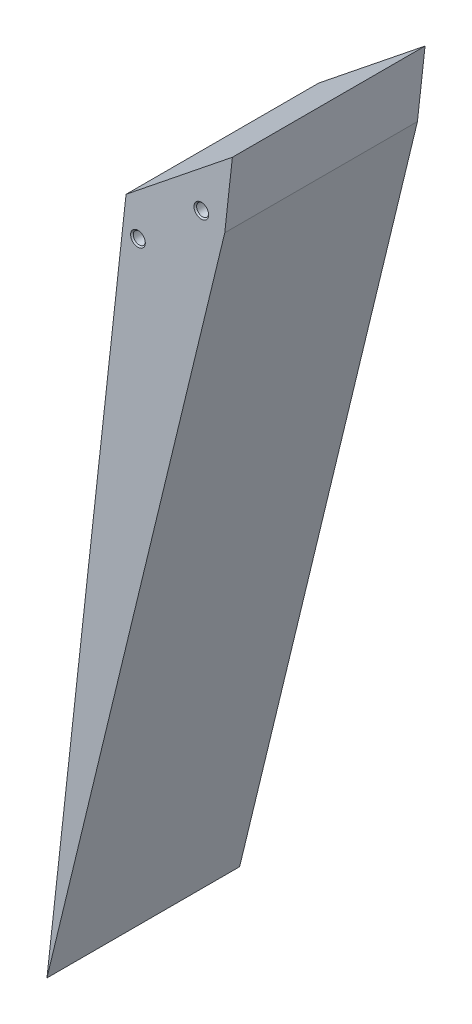
ISO-10303-21;
HEADER;
FILE_DESCRIPTION(('STEP AP214'),'2;1');
FILE_NAME('part.step','',(''),(''),'','','');
FILE_SCHEMA(('AUTOMOTIVE_DESIGN { 1 0 10303 214 1 1 1 1 }'));
ENDSEC;
DATA;
#1=APPLICATION_CONTEXT('core data for automotive mechanical design processes');
#2=APPLICATION_PROTOCOL_DEFINITION('international standard','automotive_design',2000,#1);
#3=PRODUCT_CONTEXT('',#1,'mechanical');
#4=PRODUCT('Part','Part','',(#3));
#5=PRODUCT_RELATED_PRODUCT_CATEGORY('part','',(#4));
#6=PRODUCT_DEFINITION_FORMATION('','',#4);
#7=PRODUCT_DEFINITION_CONTEXT('part definition',#1,'design');
#8=PRODUCT_DEFINITION('design','',#6,#7);
#9=PRODUCT_DEFINITION_SHAPE('','',#8);
#10=(LENGTH_UNIT() NAMED_UNIT(*) SI_UNIT(.MILLI.,.METRE.));
#11=(NAMED_UNIT(*) PLANE_ANGLE_UNIT() SI_UNIT($,.RADIAN.));
#12=(NAMED_UNIT(*) SI_UNIT($,.STERADIAN.) SOLID_ANGLE_UNIT());
#13=UNCERTAINTY_MEASURE_WITH_UNIT(LENGTH_MEASURE(1.E-05),#10,'distance_accuracy_value','');
#14=(GEOMETRIC_REPRESENTATION_CONTEXT(3) GLOBAL_UNCERTAINTY_ASSIGNED_CONTEXT((#13)) GLOBAL_UNIT_ASSIGNED_CONTEXT((#10,
#11,#12)) REPRESENTATION_CONTEXT('',''));
#15=CARTESIAN_POINT('',(0.,0.,0.));
#16=DIRECTION('',(0.,0.,1.));
#17=DIRECTION('',(1.,0.,0.));
#18=AXIS2_PLACEMENT_3D('',#15,#16,#17);
#19=CARTESIAN_POINT('',(8.23788264058282,-16.5449980445284,40.));
#20=DIRECTION('',(-0.993986963738748,0.109498474498163,0.));
#21=DIRECTION('',(-0.109498474498163,-0.993986963738748,0.));
#22=AXIS2_PLACEMENT_3D('',#19,#20,#21);
#23=PLANE('',#22);
#24=DIRECTION('',(0.109498474498163,0.993986963738748,0.));
#25=VECTOR('',#24,1.);
#26=CARTESIAN_POINT('',(8.23788264058282,-16.5449980445284,0.));
#27=LINE('',#26,#25);
#28=CARTESIAN_POINT('',(6.65491540244259,-30.9145936571441,0.));
#29=VERTEX_POINT('',#28);
#30=CARTESIAN_POINT('',(8.23788264058282,-16.5449980445284,0.));
#31=VERTEX_POINT('',#30);
#32=EDGE_CURVE('E155',#29,#31,#27,.T.);
#33=ORIENTED_EDGE('',*,*,#32,.T.);
#34=DIRECTION('',(0.,0.,-1.));
#35=VECTOR('',#34,1.);
#36=CARTESIAN_POINT('',(8.23788264058282,-16.5449980445284,40.));
#37=LINE('',#36,#35);
#38=CARTESIAN_POINT('',(8.23788264058282,-16.5449980445284,40.));
#39=VERTEX_POINT('',#38);
#40=EDGE_CURVE('E11',#39,#31,#37,.T.);
#41=ORIENTED_EDGE('',*,*,#40,.F.);
#42=DIRECTION('',(0.109498474498163,0.993986963738748,0.));
#43=VECTOR('',#42,1.);
#44=CARTESIAN_POINT('',(8.23788264058282,-16.5449980445284,40.));
#45=LINE('',#44,#43);
#46=CARTESIAN_POINT('',(6.65491540244259,-30.9145936571441,40.));
#47=VERTEX_POINT('',#46);
#48=EDGE_CURVE('E156',#47,#39,#45,.T.);
#49=ORIENTED_EDGE('',*,*,#48,.F.);
#50=DIRECTION('',(0.,0.,-1.));
#51=VECTOR('',#50,1.);
#52=CARTESIAN_POINT('',(6.65491540244259,-30.9145936571441,40.));
#53=LINE('',#52,#51);
#54=EDGE_CURVE('E162',#47,#29,#53,.T.);
#55=ORIENTED_EDGE('',*,*,#54,.T.);
#56=EDGE_LOOP('',(#33,#41,#49,#55));
#57=FACE_BOUND('',#56,.T.);
#58=ADVANCED_FACE('F51',(#57),#23,.F.);
#59=CARTESIAN_POINT('',(8.23788264058282,-16.5449980445284,40.));
#60=DIRECTION('',(0.62542780862346,-0.780282036317931,0.));
#61=DIRECTION('',(0.780282036317931,0.62542780862346,0.));
#62=AXIS2_PLACEMENT_3D('',#59,#60,#61);
#63=PLANE('',#62);
#64=DIRECTION('',(-0.780282036317931,-0.62542780862346,0.));
#65=VECTOR('',#64,1.);
#66=CARTESIAN_POINT('',(8.23788264058282,-16.5449980445284,0.));
#67=LINE('',#66,#65);
#68=CARTESIAN_POINT('',(-13.8318261241554,-34.23476782934,0.));
#69=VERTEX_POINT('',#68);
#70=EDGE_CURVE('E165',#31,#69,#67,.T.);
#71=ORIENTED_EDGE('',*,*,#70,.T.);
#72=DIRECTION('',(0.,0.,-1.));
#73=VECTOR('',#72,1.);
#74=CARTESIAN_POINT('',(-13.8318261241554,-34.23476782934,40.));
#75=LINE('',#74,#73);
#76=CARTESIAN_POINT('',(-13.8318261241554,-34.23476782934,40.));
#77=VERTEX_POINT('',#76);
#78=EDGE_CURVE('E59',#77,#69,#75,.T.);
#79=ORIENTED_EDGE('',*,*,#78,.F.);
#80=DIRECTION('',(-0.780282036317931,-0.62542780862346,0.));
#81=VECTOR('',#80,1.);
#82=CARTESIAN_POINT('',(8.23788264058282,-16.5449980445284,40.));
#83=LINE('',#82,#81);
#84=EDGE_CURVE('E98',#39,#77,#83,.T.);
#85=ORIENTED_EDGE('',*,*,#84,.F.);
#86=ORIENTED_EDGE('',*,*,#40,.T.);
#87=EDGE_LOOP('',(#71,#79,#85,#86));
#88=FACE_BOUND('',#87,.T.);
#89=ADVANCED_FACE('F190',(#88),#63,.F.);
#90=CARTESIAN_POINT('',(-13.8318261241554,-34.23476782934,40.));
#91=DIRECTION('',(0.993986963738748,-0.109498474498163,0.));
#92=DIRECTION('',(0.109498474498163,0.993986963738748,0.));
#93=AXIS2_PLACEMENT_3D('',#90,#91,#92);
#94=PLANE('',#93);
#95=DIRECTION('',(-0.109498474498163,-0.993986963738748,0.));
#96=VECTOR('',#95,1.);
#97=CARTESIAN_POINT('',(-13.8318261241554,-34.23476782934,0.));
#98=LINE('',#97,#96);
#99=CARTESIAN_POINT('',(-30.2565972988798,-183.332812390152,0.));
#100=VERTEX_POINT('',#99);
#101=EDGE_CURVE('E85',#69,#100,#98,.T.);
#102=ORIENTED_EDGE('',*,*,#101,.T.);
#103=DIRECTION('',(0.,0.,-1.));
#104=VECTOR('',#103,1.);
#105=CARTESIAN_POINT('',(-30.2565972988798,-183.332812390152,40.));
#106=LINE('',#105,#104);
#107=CARTESIAN_POINT('',(-30.2565972988798,-183.332812390152,40.));
#108=VERTEX_POINT('',#107);
#109=EDGE_CURVE('E170',#108,#100,#106,.T.);
#110=ORIENTED_EDGE('',*,*,#109,.F.);
#111=DIRECTION('',(-0.109498474498163,-0.993986963738748,0.));
#112=VECTOR('',#111,1.);
#113=CARTESIAN_POINT('',(-13.8318261241554,-34.23476782934,40.));
#114=LINE('',#113,#112);
#115=EDGE_CURVE('E159',#77,#108,#114,.T.);
#116=ORIENTED_EDGE('',*,*,#115,.F.);
#117=ORIENTED_EDGE('',*,*,#78,.T.);
#118=EDGE_LOOP('',(#102,#110,#116,#117));
#119=FACE_BOUND('',#118,.T.);
#120=ADVANCED_FACE('F172',(#119),#94,.F.);
#121=CARTESIAN_POINT('',(-30.2565972988798,-183.332812390152,40.));
#122=DIRECTION('',(-0.971906082834714,0.23536899997426,0.));
#123=DIRECTION('',(-0.23536899997426,-0.971906082834714,0.));
#124=AXIS2_PLACEMENT_3D('',#121,#122,#123);
#125=PLANE('',#124);
#126=DIRECTION('',(0.23536899997426,0.971906082834714,0.));
#127=VECTOR('',#126,1.);
#128=CARTESIAN_POINT('',(-30.2565972988798,-183.332812390152,0.));
#129=LINE('',#128,#127);
#130=EDGE_CURVE('E91',#100,#29,#129,.T.);
#131=ORIENTED_EDGE('',*,*,#130,.T.);
#132=ORIENTED_EDGE('',*,*,#54,.F.);
#133=DIRECTION('',(0.23536899997426,0.971906082834714,0.));
#134=VECTOR('',#133,1.);
#135=CARTESIAN_POINT('',(-30.2565972988798,-183.332812390152,40.));
#136=LINE('',#135,#134);
#137=EDGE_CURVE('E67',#108,#47,#136,.T.);
#138=ORIENTED_EDGE('',*,*,#137,.F.);
#139=ORIENTED_EDGE('',*,*,#109,.T.);
#140=EDGE_LOOP('',(#131,#132,#138,#139));
#141=FACE_BOUND('',#140,.T.);
#142=ADVANCED_FACE('F179',(#141),#125,.F.);
#143=CARTESIAN_POINT('',(0.,0.,40.));
#144=DIRECTION('',(0.,0.,-1.));
#145=DIRECTION('',(-1.,0.,0.));
#146=AXIS2_PLACEMENT_3D('',#143,#144,#145);
#147=PLANE('',#146);
#148=CARTESIAN_POINT('',(-11.3580472823463,-41.0028628504399,40.));
#149=DIRECTION('',(0.,0.,1.));
#150=DIRECTION('',(1.,0.,0.));
#151=AXIS2_PLACEMENT_3D('',#148,#149,#150);
#152=CIRCLE('',#151,1.525);
#153=CARTESIAN_POINT('',(-9.83304728234632,-41.0028628504399,40.));
#154=VERTEX_POINT('',#153);
#155=EDGE_CURVE('E137',#154,#154,#152,.T.);
#156=ORIENTED_EDGE('',*,*,#155,.F.);
#157=EDGE_LOOP('',(#156));
#158=FACE_BOUND('',#157,.T.);
#159=CARTESIAN_POINT('',(1.79447905824701,-29.3731143209146,40.));
#160=DIRECTION('',(0.,0.,1.));
#161=DIRECTION('',(1.,0.,0.));
#162=AXIS2_PLACEMENT_3D('',#159,#160,#161);
#163=CIRCLE('',#162,1.525);
#164=CARTESIAN_POINT('',(3.31947905824701,-29.3731143209146,40.));
#165=VERTEX_POINT('',#164);
#166=EDGE_CURVE('E146',#165,#165,#163,.T.);
#167=ORIENTED_EDGE('',*,*,#166,.F.);
#168=EDGE_LOOP('',(#167));
#169=FACE_BOUND('',#168,.T.);
#170=ORIENTED_EDGE('',*,*,#48,.T.);
#171=ORIENTED_EDGE('',*,*,#84,.T.);
#172=ORIENTED_EDGE('',*,*,#115,.T.);
#173=ORIENTED_EDGE('',*,*,#137,.T.);
#174=EDGE_LOOP('',(#170,#171,#172,#173));
#175=FACE_BOUND('',#174,.T.);
#176=ADVANCED_FACE('F181',(#158,#169,#175),#147,.F.);
#177=CARTESIAN_POINT('',(0.,0.,0.));
#178=DIRECTION('',(0.,0.,-1.));
#179=DIRECTION('',(-1.,0.,0.));
#180=AXIS2_PLACEMENT_3D('',#177,#178,#179);
#181=PLANE('',#180);
#182=CARTESIAN_POINT('',(-11.3580472823463,-41.0028628504399,0.));
#183=DIRECTION('',(0.,0.,-1.));
#184=DIRECTION('',(-1.,0.,0.));
#185=AXIS2_PLACEMENT_3D('',#182,#183,#184);
#186=CIRCLE('',#185,1.525);
#187=CARTESIAN_POINT('',(-12.8830472823463,-41.0028628504399,0.));
#188=VERTEX_POINT('',#187);
#189=EDGE_CURVE('E128',#188,#188,#186,.T.);
#190=ORIENTED_EDGE('',*,*,#189,.F.);
#191=EDGE_LOOP('',(#190));
#192=FACE_BOUND('',#191,.T.);
#193=CARTESIAN_POINT('',(1.79447905824701,-29.3731143209146,0.));
#194=DIRECTION('',(0.,0.,-1.));
#195=DIRECTION('',(-1.,0.,0.));
#196=AXIS2_PLACEMENT_3D('',#193,#194,#195);
#197=CIRCLE('',#196,1.525);
#198=CARTESIAN_POINT('',(0.269479058247011,-29.3731143209146,0.));
#199=VERTEX_POINT('',#198);
#200=EDGE_CURVE('E121',#199,#199,#197,.T.);
#201=ORIENTED_EDGE('',*,*,#200,.F.);
#202=EDGE_LOOP('',(#201));
#203=FACE_BOUND('',#202,.T.);
#204=ORIENTED_EDGE('',*,*,#32,.F.);
#205=ORIENTED_EDGE('',*,*,#130,.F.);
#206=ORIENTED_EDGE('',*,*,#101,.F.);
#207=ORIENTED_EDGE('',*,*,#70,.F.);
#208=EDGE_LOOP('',(#204,#205,#206,#207));
#209=FACE_BOUND('',#208,.T.);
#210=ADVANCED_FACE('F175',(#192,#203,#209),#181,.T.);
#211=CARTESIAN_POINT('',(1.79447905824701,-29.3731143209146,32.5));
#212=DIRECTION('',(0.,0.,1.));
#213=DIRECTION('',(1.,0.,0.));
#214=AXIS2_PLACEMENT_3D('',#211,#212,#213);
#215=CONICAL_SURFACE('',#214,1.25,1.02974425867665);
#216=CARTESIAN_POINT('',(1.79447905824701,-29.3731143209146,31.7489242262155));
#217=VERTEX_POINT('',#216);
#218=VERTEX_LOOP('',#217);
#219=FACE_BOUND('',#218,.T.);
#220=CARTESIAN_POINT('',(1.79447905824701,-29.3731143209146,32.5));
#221=DIRECTION('',(0.,0.,1.));
#222=DIRECTION('',(1.,0.,0.));
#223=AXIS2_PLACEMENT_3D('',#220,#221,#222);
#224=CIRCLE('',#223,1.25);
#225=CARTESIAN_POINT('',(3.04447905824701,-29.3731143209146,32.5));
#226=VERTEX_POINT('',#225);
#227=EDGE_CURVE('E152',#226,#226,#224,.T.);
#228=ORIENTED_EDGE('',*,*,#227,.T.);
#229=EDGE_LOOP('',(#228));
#230=FACE_BOUND('',#229,.T.);
#231=ADVANCED_FACE('F227',(#219,#230),#215,.F.);
#232=CARTESIAN_POINT('',(1.79447905824701,-29.3731143209146,40.));
#233=DIRECTION('',(0.,0.,1.));
#234=DIRECTION('',(1.,0.,0.));
#235=AXIS2_PLACEMENT_3D('',#232,#233,#234);
#236=CYLINDRICAL_SURFACE('',#235,1.25);
#237=ORIENTED_EDGE('',*,*,#227,.F.);
#238=EDGE_LOOP('',(#237));
#239=FACE_BOUND('',#238,.T.);
#240=CARTESIAN_POINT('',(1.79447905824701,-29.3731143209146,39.725));
#241=DIRECTION('',(0.,0.,1.));
#242=DIRECTION('',(1.,0.,0.));
#243=AXIS2_PLACEMENT_3D('',#240,#241,#242);
#244=CIRCLE('',#243,1.25);
#245=CARTESIAN_POINT('',(3.04447905824701,-29.3731143209146,39.725));
#246=VERTEX_POINT('',#245);
#247=EDGE_CURVE('E149',#246,#246,#244,.T.);
#248=ORIENTED_EDGE('',*,*,#247,.T.);
#249=EDGE_LOOP('',(#248));
#250=FACE_BOUND('',#249,.T.);
#251=ADVANCED_FACE('F238',(#239,#250),#236,.F.);
#252=CARTESIAN_POINT('',(1.79447905824701,-29.3731143209146,40.));
#253=DIRECTION('',(0.,0.,1.));
#254=DIRECTION('',(1.,0.,0.));
#255=AXIS2_PLACEMENT_3D('',#252,#253,#254);
#256=CONICAL_SURFACE('',#255,1.525,0.785398163397454);
#257=ORIENTED_EDGE('',*,*,#247,.F.);
#258=EDGE_LOOP('',(#257));
#259=FACE_BOUND('',#258,.T.);
#260=ORIENTED_EDGE('',*,*,#166,.T.);
#261=EDGE_LOOP('',(#260));
#262=FACE_BOUND('',#261,.T.);
#263=ADVANCED_FACE('F249',(#259,#262),#256,.F.);
#264=CARTESIAN_POINT('',(-11.3580472823463,-41.0028628504399,32.5));
#265=DIRECTION('',(0.,0.,1.));
#266=DIRECTION('',(1.,0.,0.));
#267=AXIS2_PLACEMENT_3D('',#264,#265,#266);
#268=CONICAL_SURFACE('',#267,1.25,1.02974425867665);
#269=CARTESIAN_POINT('',(-11.3580472823463,-41.0028628504399,31.7489242262155));
#270=VERTEX_POINT('',#269);
#271=VERTEX_LOOP('',#270);
#272=FACE_BOUND('',#271,.T.);
#273=CARTESIAN_POINT('',(-11.3580472823463,-41.0028628504399,32.5));
#274=DIRECTION('',(0.,0.,1.));
#275=DIRECTION('',(1.,0.,0.));
#276=AXIS2_PLACEMENT_3D('',#273,#274,#275);
#277=CIRCLE('',#276,1.25);
#278=CARTESIAN_POINT('',(-10.1080472823463,-41.0028628504399,32.5));
#279=VERTEX_POINT('',#278);
#280=EDGE_CURVE('E143',#279,#279,#277,.T.);
#281=ORIENTED_EDGE('',*,*,#280,.T.);
#282=EDGE_LOOP('',(#281));
#283=FACE_BOUND('',#282,.T.);
#284=ADVANCED_FACE('F261',(#272,#283),#268,.F.);
#285=CARTESIAN_POINT('',(-11.3580472823463,-41.0028628504399,40.));
#286=DIRECTION('',(0.,0.,1.));
#287=DIRECTION('',(1.,0.,0.));
#288=AXIS2_PLACEMENT_3D('',#285,#286,#287);
#289=CYLINDRICAL_SURFACE('',#288,1.25);
#290=ORIENTED_EDGE('',*,*,#280,.F.);
#291=EDGE_LOOP('',(#290));
#292=FACE_BOUND('',#291,.T.);
#293=CARTESIAN_POINT('',(-11.3580472823463,-41.0028628504399,39.725));
#294=DIRECTION('',(0.,0.,1.));
#295=DIRECTION('',(1.,0.,0.));
#296=AXIS2_PLACEMENT_3D('',#293,#294,#295);
#297=CIRCLE('',#296,1.25);
#298=CARTESIAN_POINT('',(-10.1080472823463,-41.0028628504399,39.725));
#299=VERTEX_POINT('',#298);
#300=EDGE_CURVE('E140',#299,#299,#297,.T.);
#301=ORIENTED_EDGE('',*,*,#300,.T.);
#302=EDGE_LOOP('',(#301));
#303=FACE_BOUND('',#302,.T.);
#304=ADVANCED_FACE('F271',(#292,#303),#289,.F.);
#305=CARTESIAN_POINT('',(-11.3580472823463,-41.0028628504399,40.));
#306=DIRECTION('',(0.,0.,1.));
#307=DIRECTION('',(1.,0.,0.));
#308=AXIS2_PLACEMENT_3D('',#305,#306,#307);
#309=CONICAL_SURFACE('',#308,1.525,0.785398163397455);
#310=ORIENTED_EDGE('',*,*,#300,.F.);
#311=EDGE_LOOP('',(#310));
#312=FACE_BOUND('',#311,.T.);
#313=ORIENTED_EDGE('',*,*,#155,.T.);
#314=EDGE_LOOP('',(#313));
#315=FACE_BOUND('',#314,.T.);
#316=ADVANCED_FACE('F282',(#312,#315),#309,.F.);
#317=CARTESIAN_POINT('',(1.79447905824701,-29.3731143209146,7.5));
#318=DIRECTION('',(0.,0.,-1.));
#319=DIRECTION('',(-1.,0.,0.));
#320=AXIS2_PLACEMENT_3D('',#317,#318,#319);
#321=CONICAL_SURFACE('',#320,1.25,1.02974425867665);
#322=CARTESIAN_POINT('',(1.79447905824701,-29.3731143209146,8.25107577378445));
#323=VERTEX_POINT('',#322);
#324=VERTEX_LOOP('',#323);
#325=FACE_BOUND('',#324,.T.);
#326=CARTESIAN_POINT('',(1.79447905824701,-29.3731143209146,7.5));
#327=DIRECTION('',(0.,0.,-1.));
#328=DIRECTION('',(-1.,0.,0.));
#329=AXIS2_PLACEMENT_3D('',#326,#327,#328);
#330=CIRCLE('',#329,1.25);
#331=CARTESIAN_POINT('',(0.544479058247014,-29.3731143209146,7.5));
#332=VERTEX_POINT('',#331);
#333=EDGE_CURVE('E134',#332,#332,#330,.T.);
#334=ORIENTED_EDGE('',*,*,#333,.T.);
#335=EDGE_LOOP('',(#334));
#336=FACE_BOUND('',#335,.T.);
#337=ADVANCED_FACE('F293',(#325,#336),#321,.F.);
#338=CARTESIAN_POINT('',(1.79447905824701,-29.3731143209146,0.));
#339=DIRECTION('',(0.,0.,-1.));
#340=DIRECTION('',(-1.,0.,0.));
#341=AXIS2_PLACEMENT_3D('',#338,#339,#340);
#342=CYLINDRICAL_SURFACE('',#341,1.25);
#343=ORIENTED_EDGE('',*,*,#333,.F.);
#344=EDGE_LOOP('',(#343));
#345=FACE_BOUND('',#344,.T.);
#346=CARTESIAN_POINT('',(1.79447905824701,-29.3731143209146,0.275));
#347=DIRECTION('',(0.,0.,-1.));
#348=DIRECTION('',(-1.,0.,0.));
#349=AXIS2_PLACEMENT_3D('',#346,#347,#348);
#350=CIRCLE('',#349,1.25);
#351=CARTESIAN_POINT('',(0.544479058247012,-29.3731143209146,0.275));
#352=VERTEX_POINT('',#351);
#353=EDGE_CURVE('E125',#352,#352,#350,.T.);
#354=ORIENTED_EDGE('',*,*,#353,.T.);
#355=EDGE_LOOP('',(#354));
#356=FACE_BOUND('',#355,.T.);
#357=ADVANCED_FACE('F302',(#345,#356),#342,.F.);
#358=CARTESIAN_POINT('',(1.79447905824701,-29.3731143209146,0.));
#359=DIRECTION('',(0.,0.,-1.));
#360=DIRECTION('',(-1.,0.,0.));
#361=AXIS2_PLACEMENT_3D('',#358,#359,#360);
#362=CONICAL_SURFACE('',#361,1.525,0.785398163397449);
#363=ORIENTED_EDGE('',*,*,#353,.F.);
#364=EDGE_LOOP('',(#363));
#365=FACE_BOUND('',#364,.T.);
#366=ORIENTED_EDGE('',*,*,#200,.T.);
#367=EDGE_LOOP('',(#366));
#368=FACE_BOUND('',#367,.T.);
#369=ADVANCED_FACE('F115',(#365,#368),#362,.F.);
#370=CARTESIAN_POINT('',(-11.3580472823463,-41.0028628504399,7.5));
#371=DIRECTION('',(0.,0.,-1.));
#372=DIRECTION('',(-1.,0.,0.));
#373=AXIS2_PLACEMENT_3D('',#370,#371,#372);
#374=CONICAL_SURFACE('',#373,1.25,1.02974425867665);
#375=CARTESIAN_POINT('',(-11.3580472823463,-41.0028628504399,8.25107577378445));
#376=VERTEX_POINT('',#375);
#377=VERTEX_LOOP('',#376);
#378=FACE_BOUND('',#377,.T.);
#379=CARTESIAN_POINT('',(-11.3580472823463,-41.0028628504399,7.5));
#380=DIRECTION('',(0.,0.,-1.));
#381=DIRECTION('',(-1.,0.,0.));
#382=AXIS2_PLACEMENT_3D('',#379,#380,#381);
#383=CIRCLE('',#382,1.25);
#384=CARTESIAN_POINT('',(-12.6080472823463,-41.0028628504399,7.5));
#385=VERTEX_POINT('',#384);
#386=EDGE_CURVE('E119',#385,#385,#383,.T.);
#387=ORIENTED_EDGE('',*,*,#386,.T.);
#388=EDGE_LOOP('',(#387));
#389=FACE_BOUND('',#388,.T.);
#390=ADVANCED_FACE('F111',(#378,#389),#374,.F.);
#391=CARTESIAN_POINT('',(-11.3580472823463,-41.0028628504399,0.));
#392=DIRECTION('',(0.,0.,-1.));
#393=DIRECTION('',(-1.,0.,0.));
#394=AXIS2_PLACEMENT_3D('',#391,#392,#393);
#395=CYLINDRICAL_SURFACE('',#394,1.25);
#396=ORIENTED_EDGE('',*,*,#386,.F.);
#397=EDGE_LOOP('',(#396));
#398=FACE_BOUND('',#397,.T.);
#399=CARTESIAN_POINT('',(-11.3580472823463,-41.0028628504399,0.275));
#400=DIRECTION('',(0.,0.,-1.));
#401=DIRECTION('',(-1.,0.,0.));
#402=AXIS2_PLACEMENT_3D('',#399,#400,#401);
#403=CIRCLE('',#402,1.25);
#404=CARTESIAN_POINT('',(-12.6080472823463,-41.0028628504399,0.275));
#405=VERTEX_POINT('',#404);
#406=EDGE_CURVE('E122',#405,#405,#403,.T.);
#407=ORIENTED_EDGE('',*,*,#406,.T.);
#408=EDGE_LOOP('',(#407));
#409=FACE_BOUND('',#408,.T.);
#410=ADVANCED_FACE('F114',(#398,#409),#395,.F.);
#411=CARTESIAN_POINT('',(-11.3580472823463,-41.0028628504399,0.));
#412=DIRECTION('',(0.,0.,-1.));
#413=DIRECTION('',(-1.,0.,0.));
#414=AXIS2_PLACEMENT_3D('',#411,#412,#413);
#415=CONICAL_SURFACE('',#414,1.525,0.78539816339745);
#416=ORIENTED_EDGE('',*,*,#406,.F.);
#417=EDGE_LOOP('',(#416));
#418=FACE_BOUND('',#417,.T.);
#419=ORIENTED_EDGE('',*,*,#189,.T.);
#420=EDGE_LOOP('',(#419));
#421=FACE_BOUND('',#420,.T.);
#422=ADVANCED_FACE('F340',(#418,#421),#415,.F.);
#423=CLOSED_SHELL('',(#58,#89,#120,#142,#176,#210,#231,#251,#263,#284,#304,#316,#337,#357,#369,
#390,#410,#422));
#424=MANIFOLD_SOLID_BREP('B2',#423);
#425=ADVANCED_BREP_SHAPE_REPRESENTATION('',(#18,#424),#14);
#426=SHAPE_DEFINITION_REPRESENTATION(#9,#425);
ENDSEC;
END-ISO-10303-21;
